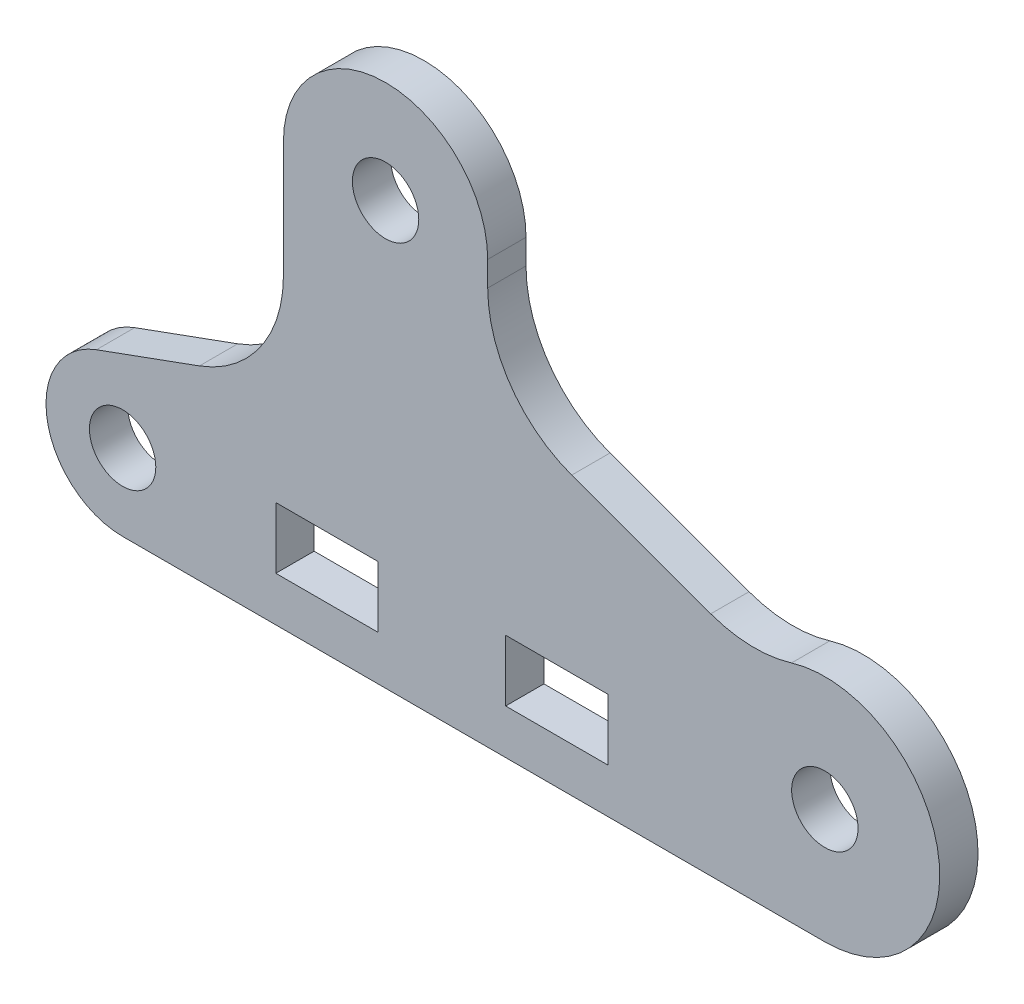
ISO-10303-21;
HEADER;
FILE_DESCRIPTION(('STEP AP214'),'2;1');
FILE_NAME('part.step','',(''),(''),'','','');
FILE_SCHEMA(('AUTOMOTIVE_DESIGN { 1 0 10303 214 1 1 1 1 }'));
ENDSEC;
DATA;
#1=APPLICATION_CONTEXT('core data for automotive mechanical design processes');
#2=APPLICATION_PROTOCOL_DEFINITION('international standard','automotive_design',2000,#1);
#3=PRODUCT_CONTEXT('',#1,'mechanical');
#4=PRODUCT('Part','Part','',(#3));
#5=PRODUCT_RELATED_PRODUCT_CATEGORY('part','',(#4));
#6=PRODUCT_DEFINITION_FORMATION('','',#4);
#7=PRODUCT_DEFINITION_CONTEXT('part definition',#1,'design');
#8=PRODUCT_DEFINITION('design','',#6,#7);
#9=PRODUCT_DEFINITION_SHAPE('','',#8);
#10=(LENGTH_UNIT() NAMED_UNIT(*) SI_UNIT(.MILLI.,.METRE.));
#11=(NAMED_UNIT(*) PLANE_ANGLE_UNIT() SI_UNIT($,.RADIAN.));
#12=(NAMED_UNIT(*) SI_UNIT($,.STERADIAN.) SOLID_ANGLE_UNIT());
#13=UNCERTAINTY_MEASURE_WITH_UNIT(LENGTH_MEASURE(1.E-05),#10,'distance_accuracy_value','');
#14=(GEOMETRIC_REPRESENTATION_CONTEXT(3) GLOBAL_UNCERTAINTY_ASSIGNED_CONTEXT((#13)) GLOBAL_UNIT_ASSIGNED_CONTEXT((#10,
#11,#12)) REPRESENTATION_CONTEXT('',''));
#15=CARTESIAN_POINT('',(0.,0.,0.));
#16=DIRECTION('',(0.,0.,1.));
#17=DIRECTION('',(1.,0.,0.));
#18=AXIS2_PLACEMENT_3D('',#15,#16,#17);
#19=CARTESIAN_POINT('',(-43.,-5.50000000000001,-3.));
#20=DIRECTION('',(0.,-1.,0.));
#21=DIRECTION('',(0.,0.,-1.));
#22=AXIS2_PLACEMENT_3D('',#19,#20,#21);
#23=PLANE('',#22);
#24=DIRECTION('',(0.,0.,1.));
#25=VECTOR('',#24,1.);
#26=CARTESIAN_POINT('',(-43.,-5.50000000000001,-3.));
#27=LINE('',#26,#25);
#28=CARTESIAN_POINT('',(-43.,-5.50000000000001,0.));
#29=VERTEX_POINT('',#28);
#30=CARTESIAN_POINT('',(-43.,-5.50000000000001,3.));
#31=VERTEX_POINT('',#30);
#32=EDGE_CURVE('E207',#29,#31,#27,.T.);
#33=ORIENTED_EDGE('',*,*,#32,.T.);
#34=DIRECTION('',(1.,0.,0.));
#35=VECTOR('',#34,1.);
#36=CARTESIAN_POINT('',(-43.,-5.50000000000001,3.));
#37=LINE('',#36,#35);
#38=CARTESIAN_POINT('',(-35.,-5.50000000000001,3.));
#39=VERTEX_POINT('',#38);
#40=EDGE_CURVE('E210',#31,#39,#37,.T.);
#41=ORIENTED_EDGE('',*,*,#40,.T.);
#42=DIRECTION('',(0.,0.,1.));
#43=VECTOR('',#42,1.);
#44=CARTESIAN_POINT('',(-35.,-5.50000000000001,0.));
#45=LINE('',#44,#43);
#46=CARTESIAN_POINT('',(-35.,-5.50000000000001,0.));
#47=VERTEX_POINT('',#46);
#48=EDGE_CURVE('E199',#47,#39,#45,.T.);
#49=ORIENTED_EDGE('',*,*,#48,.F.);
#50=DIRECTION('',(1.,0.,0.));
#51=VECTOR('',#50,1.);
#52=CARTESIAN_POINT('',(-55.,-5.50000000000001,0.));
#53=LINE('',#52,#51);
#54=EDGE_CURVE('E256',#47,#29,#53,.F.);
#55=ORIENTED_EDGE('',*,*,#54,.T.);
#56=EDGE_LOOP('',(#33,#41,#49,#55));
#57=FACE_BOUND('',#56,.T.);
#58=ADVANCED_FACE('F33',(#57),#23,.F.);
#59=CARTESIAN_POINT('',(-43.,-0.700000000000009,-3.));
#60=DIRECTION('',(-1.,0.,0.));
#61=DIRECTION('',(0.,0.,1.));
#62=AXIS2_PLACEMENT_3D('',#59,#60,#61);
#63=PLANE('',#62);
#64=DIRECTION('',(0.,0.,1.));
#65=VECTOR('',#64,1.);
#66=CARTESIAN_POINT('',(-43.,-0.700000000000009,-3.));
#67=LINE('',#66,#65);
#68=CARTESIAN_POINT('',(-43.,-0.700000000000009,0.));
#69=VERTEX_POINT('',#68);
#70=CARTESIAN_POINT('',(-43.,-0.700000000000009,3.));
#71=VERTEX_POINT('',#70);
#72=EDGE_CURVE('E204',#69,#71,#67,.T.);
#73=ORIENTED_EDGE('',*,*,#72,.T.);
#74=DIRECTION('',(0.,-1.,0.));
#75=VECTOR('',#74,1.);
#76=CARTESIAN_POINT('',(-43.,-0.700000000000009,3.));
#77=LINE('',#76,#75);
#78=EDGE_CURVE('E307',#71,#31,#77,.T.);
#79=ORIENTED_EDGE('',*,*,#78,.T.);
#80=ORIENTED_EDGE('',*,*,#32,.F.);
#81=DIRECTION('',(0.,1.,0.));
#82=VECTOR('',#81,1.);
#83=CARTESIAN_POINT('',(-43.,-3.00000000000001,0.));
#84=LINE('',#83,#82);
#85=EDGE_CURVE('E253',#29,#69,#84,.T.);
#86=ORIENTED_EDGE('',*,*,#85,.T.);
#87=EDGE_LOOP('',(#73,#79,#80,#86));
#88=FACE_BOUND('',#87,.T.);
#89=ADVANCED_FACE('F448',(#88),#63,.F.);
#90=CARTESIAN_POINT('',(-43.,-0.700000000000009,-3.));
#91=DIRECTION('',(0.,1.,0.));
#92=DIRECTION('',(0.,0.,1.));
#93=AXIS2_PLACEMENT_3D('',#90,#91,#92);
#94=PLANE('',#93);
#95=DIRECTION('',(0.,0.,1.));
#96=VECTOR('',#95,1.);
#97=CARTESIAN_POINT('',(-35.,-0.700000000000009,0.));
#98=LINE('',#97,#96);
#99=CARTESIAN_POINT('',(-35.,-0.700000000000009,3.));
#100=VERTEX_POINT('',#99);
#101=CARTESIAN_POINT('',(-35.,-0.700000000000009,0.));
#102=VERTEX_POINT('',#101);
#103=EDGE_CURVE('E202',#100,#102,#98,.F.);
#104=ORIENTED_EDGE('',*,*,#103,.F.);
#105=DIRECTION('',(-1.,0.,0.));
#106=VECTOR('',#105,1.);
#107=CARTESIAN_POINT('',(-43.,-0.700000000000009,3.));
#108=LINE('',#107,#106);
#109=EDGE_CURVE('E47',#100,#71,#108,.T.);
#110=ORIENTED_EDGE('',*,*,#109,.T.);
#111=ORIENTED_EDGE('',*,*,#72,.F.);
#112=DIRECTION('',(1.,0.,0.));
#113=VECTOR('',#112,1.);
#114=CARTESIAN_POINT('',(-55.,-0.700000000000009,0.));
#115=LINE('',#114,#113);
#116=EDGE_CURVE('E250',#69,#102,#115,.T.);
#117=ORIENTED_EDGE('',*,*,#116,.T.);
#118=EDGE_LOOP('',(#104,#110,#111,#117));
#119=FACE_BOUND('',#118,.T.);
#120=ADVANCED_FACE('F445',(#119),#94,.F.);
#121=CARTESIAN_POINT('',(-35.,-0.700000000000009,0.));
#122=DIRECTION('',(-1.,0.,0.));
#123=DIRECTION('',(0.,0.,1.));
#124=AXIS2_PLACEMENT_3D('',#121,#122,#123);
#125=PLANE('',#124);
#126=DIRECTION('',(0.,-1.,0.));
#127=VECTOR('',#126,1.);
#128=CARTESIAN_POINT('',(-35.,-0.700000000000009,3.));
#129=LINE('',#128,#127);
#130=EDGE_CURVE('E311',#100,#39,#129,.T.);
#131=ORIENTED_EDGE('',*,*,#130,.F.);
#132=ORIENTED_EDGE('',*,*,#103,.T.);
#133=DIRECTION('',(0.,1.,0.));
#134=VECTOR('',#133,1.);
#135=CARTESIAN_POINT('',(-35.,-3.00000000000001,0.));
#136=LINE('',#135,#134);
#137=EDGE_CURVE('E247',#102,#47,#136,.F.);
#138=ORIENTED_EDGE('',*,*,#137,.T.);
#139=ORIENTED_EDGE('',*,*,#48,.T.);
#140=EDGE_LOOP('',(#131,#132,#138,#139));
#141=FACE_BOUND('',#140,.T.);
#142=ADVANCED_FACE('F441',(#141),#125,.T.);
#143=CARTESIAN_POINT('',(-17.,-0.700000000000009,-3.));
#144=DIRECTION('',(1.,0.,0.));
#145=DIRECTION('',(0.,0.,-1.));
#146=AXIS2_PLACEMENT_3D('',#143,#144,#145);
#147=PLANE('',#146);
#148=DIRECTION('',(0.,0.,-1.));
#149=VECTOR('',#148,1.);
#150=CARTESIAN_POINT('',(-17.,-5.50000000000001,-3.));
#151=LINE('',#150,#149);
#152=CARTESIAN_POINT('',(-17.,-5.50000000000001,0.));
#153=VERTEX_POINT('',#152);
#154=CARTESIAN_POINT('',(-17.,-5.50000000000001,3.));
#155=VERTEX_POINT('',#154);
#156=EDGE_CURVE('E196',#153,#155,#151,.F.);
#157=ORIENTED_EDGE('',*,*,#156,.T.);
#158=DIRECTION('',(0.,1.,0.));
#159=VECTOR('',#158,1.);
#160=CARTESIAN_POINT('',(-17.,-0.700000000000009,3.));
#161=LINE('',#160,#159);
#162=CARTESIAN_POINT('',(-17.,-0.700000000000009,3.));
#163=VERTEX_POINT('',#162);
#164=EDGE_CURVE('E313',#155,#163,#161,.T.);
#165=ORIENTED_EDGE('',*,*,#164,.T.);
#166=DIRECTION('',(0.,0.,1.));
#167=VECTOR('',#166,1.);
#168=CARTESIAN_POINT('',(-17.,-0.700000000000009,-3.));
#169=LINE('',#168,#167);
#170=CARTESIAN_POINT('',(-17.,-0.700000000000009,0.));
#171=VERTEX_POINT('',#170);
#172=EDGE_CURVE('E189',#163,#171,#169,.F.);
#173=ORIENTED_EDGE('',*,*,#172,.T.);
#174=DIRECTION('',(0.,1.,0.));
#175=VECTOR('',#174,1.);
#176=CARTESIAN_POINT('',(-17.,-3.00000000000001,0.));
#177=LINE('',#176,#175);
#178=EDGE_CURVE('E244',#171,#153,#177,.F.);
#179=ORIENTED_EDGE('',*,*,#178,.T.);
#180=EDGE_LOOP('',(#157,#165,#173,#179));
#181=FACE_BOUND('',#180,.T.);
#182=ADVANCED_FACE('F437',(#181),#147,.F.);
#183=CARTESIAN_POINT('',(-43.,-5.50000000000001,-3.));
#184=DIRECTION('',(0.,-1.,0.));
#185=DIRECTION('',(0.,0.,-1.));
#186=AXIS2_PLACEMENT_3D('',#183,#184,#185);
#187=PLANE('',#186);
#188=DIRECTION('',(0.,0.,-1.));
#189=VECTOR('',#188,1.);
#190=CARTESIAN_POINT('',(-25.,-5.50000000000001,0.));
#191=LINE('',#190,#189);
#192=CARTESIAN_POINT('',(-25.,-5.50000000000001,3.));
#193=VERTEX_POINT('',#192);
#194=CARTESIAN_POINT('',(-25.,-5.50000000000001,0.));
#195=VERTEX_POINT('',#194);
#196=EDGE_CURVE('E194',#193,#195,#191,.T.);
#197=ORIENTED_EDGE('',*,*,#196,.F.);
#198=DIRECTION('',(1.,0.,0.));
#199=VECTOR('',#198,1.);
#200=CARTESIAN_POINT('',(-43.,-5.50000000000001,3.));
#201=LINE('',#200,#199);
#202=EDGE_CURVE('E316',#193,#155,#201,.T.);
#203=ORIENTED_EDGE('',*,*,#202,.T.);
#204=ORIENTED_EDGE('',*,*,#156,.F.);
#205=DIRECTION('',(1.,0.,0.));
#206=VECTOR('',#205,1.);
#207=CARTESIAN_POINT('',(-55.,-5.50000000000001,0.));
#208=LINE('',#207,#206);
#209=EDGE_CURVE('E238',#153,#195,#208,.F.);
#210=ORIENTED_EDGE('',*,*,#209,.T.);
#211=EDGE_LOOP('',(#197,#203,#204,#210));
#212=FACE_BOUND('',#211,.T.);
#213=ADVANCED_FACE('F433',(#212),#187,.F.);
#214=CARTESIAN_POINT('',(-25.,-0.700000000000009,0.));
#215=DIRECTION('',(1.,0.,0.));
#216=DIRECTION('',(0.,0.,-1.));
#217=AXIS2_PLACEMENT_3D('',#214,#215,#216);
#218=PLANE('',#217);
#219=DIRECTION('',(0.,1.,0.));
#220=VECTOR('',#219,1.);
#221=CARTESIAN_POINT('',(-25.,-0.700000000000009,3.));
#222=LINE('',#221,#220);
#223=CARTESIAN_POINT('',(-25.,-0.700000000000009,3.));
#224=VERTEX_POINT('',#223);
#225=EDGE_CURVE('E55',#193,#224,#222,.T.);
#226=ORIENTED_EDGE('',*,*,#225,.F.);
#227=ORIENTED_EDGE('',*,*,#196,.T.);
#228=DIRECTION('',(0.,1.,0.));
#229=VECTOR('',#228,1.);
#230=CARTESIAN_POINT('',(-25.,-3.00000000000001,0.));
#231=LINE('',#230,#229);
#232=CARTESIAN_POINT('',(-25.,-0.700000000000009,0.));
#233=VERTEX_POINT('',#232);
#234=EDGE_CURVE('E232',#195,#233,#231,.T.);
#235=ORIENTED_EDGE('',*,*,#234,.T.);
#236=DIRECTION('',(0.,0.,1.));
#237=VECTOR('',#236,1.);
#238=CARTESIAN_POINT('',(-25.,-0.700000000000009,-3.));
#239=LINE('',#238,#237);
#240=EDGE_CURVE('E184',#233,#224,#239,.T.);
#241=ORIENTED_EDGE('',*,*,#240,.T.);
#242=EDGE_LOOP('',(#226,#227,#235,#241));
#243=FACE_BOUND('',#242,.T.);
#244=ADVANCED_FACE('F430',(#243),#218,.T.);
#245=CARTESIAN_POINT('',(-43.,-0.700000000000009,-3.));
#246=DIRECTION('',(0.,1.,0.));
#247=DIRECTION('',(0.,0.,1.));
#248=AXIS2_PLACEMENT_3D('',#245,#246,#247);
#249=PLANE('',#248);
#250=ORIENTED_EDGE('',*,*,#172,.F.);
#251=DIRECTION('',(-1.,0.,0.));
#252=VECTOR('',#251,1.);
#253=CARTESIAN_POINT('',(-43.,-0.700000000000009,3.));
#254=LINE('',#253,#252);
#255=EDGE_CURVE('E177',#163,#224,#254,.T.);
#256=ORIENTED_EDGE('',*,*,#255,.T.);
#257=ORIENTED_EDGE('',*,*,#240,.F.);
#258=DIRECTION('',(1.,0.,0.));
#259=VECTOR('',#258,1.);
#260=CARTESIAN_POINT('',(-55.,-0.700000000000009,0.));
#261=LINE('',#260,#259);
#262=EDGE_CURVE('E229',#233,#171,#261,.T.);
#263=ORIENTED_EDGE('',*,*,#262,.T.);
#264=EDGE_LOOP('',(#250,#256,#257,#263));
#265=FACE_BOUND('',#264,.T.);
#266=ADVANCED_FACE('F427',(#265),#249,.F.);
#267=CARTESIAN_POINT('',(0.,-9.,5.));
#268=DIRECTION('',(0.,1.,0.));
#269=DIRECTION('',(-1.,0.,0.));
#270=AXIS2_PLACEMENT_3D('',#267,#268,#269);
#271=PLANE('',#270);
#272=DIRECTION('',(0.,0.,-1.));
#273=VECTOR('',#272,1.);
#274=CARTESIAN_POINT('',(0.,-9.,5.));
#275=LINE('',#274,#273);
#276=CARTESIAN_POINT('',(0.,-9.,3.));
#277=VERTEX_POINT('',#276);
#278=CARTESIAN_POINT('',(0.,-9.00000000000001,0.));
#279=VERTEX_POINT('',#278);
#280=EDGE_CURVE('E176',#277,#279,#275,.T.);
#281=ORIENTED_EDGE('',*,*,#280,.F.);
#282=DIRECTION('',(-1.,0.,0.));
#283=VECTOR('',#282,1.);
#284=CARTESIAN_POINT('',(0.,-9.,3.));
#285=LINE('',#284,#283);
#286=CARTESIAN_POINT('',(-55.,-9.00000000000001,3.));
#287=VERTEX_POINT('',#286);
#288=EDGE_CURVE('E163',#277,#287,#285,.T.);
#289=ORIENTED_EDGE('',*,*,#288,.T.);
#290=DIRECTION('',(0.,0.,1.));
#291=VECTOR('',#290,1.);
#292=CARTESIAN_POINT('',(-55.,-9.00000000000001,5.));
#293=LINE('',#292,#291);
#294=CARTESIAN_POINT('',(-55.,-9.00000000000001,0.));
#295=VERTEX_POINT('',#294);
#296=EDGE_CURVE('E174',#295,#287,#293,.T.);
#297=ORIENTED_EDGE('',*,*,#296,.F.);
#298=DIRECTION('',(1.,0.,0.));
#299=VECTOR('',#298,1.);
#300=CARTESIAN_POINT('',(-55.,-9.00000000000001,0.));
#301=LINE('',#300,#299);
#302=EDGE_CURVE('E228',#295,#279,#301,.T.);
#303=ORIENTED_EDGE('',*,*,#302,.T.);
#304=EDGE_LOOP('',(#281,#289,#297,#303));
#305=FACE_BOUND('',#304,.T.);
#306=ADVANCED_FACE('F172',(#305),#271,.F.);
#307=CARTESIAN_POINT('',(0.,0.,5.));
#308=DIRECTION('',(0.,0.,-1.));
#309=DIRECTION('',(-1.,0.,0.));
#310=AXIS2_PLACEMENT_3D('',#307,#308,#309);
#311=CYLINDRICAL_SURFACE('',#310,9.);
#312=CARTESIAN_POINT('',(0.,0.,3.));
#313=DIRECTION('',(0.,0.,-1.));
#314=DIRECTION('',(-1.,0.,0.));
#315=AXIS2_PLACEMENT_3D('',#312,#313,#314);
#316=CIRCLE('',#315,9.);
#317=CARTESIAN_POINT('',(-2.61173540827363,8.61271375102933,3.));
#318=VERTEX_POINT('',#317);
#319=EDGE_CURVE('E178',#277,#318,#316,.F.);
#320=ORIENTED_EDGE('',*,*,#319,.F.);
#321=ORIENTED_EDGE('',*,*,#280,.T.);
#322=CARTESIAN_POINT('',(0.,0.,0.));
#323=DIRECTION('',(0.,0.,-1.));
#324=DIRECTION('',(-1.,0.,0.));
#325=AXIS2_PLACEMENT_3D('',#322,#323,#324);
#326=CIRCLE('',#325,9.);
#327=CARTESIAN_POINT('',(-2.61173540827363,8.61271375102933,0.));
#328=VERTEX_POINT('',#327);
#329=EDGE_CURVE('E226',#279,#328,#326,.F.);
#330=ORIENTED_EDGE('',*,*,#329,.T.);
#331=DIRECTION('',(0.,0.,-1.));
#332=VECTOR('',#331,1.);
#333=CARTESIAN_POINT('',(-2.61173540827363,8.61271375102933,5.));
#334=LINE('',#333,#332);
#335=EDGE_CURVE('E186',#328,#318,#334,.F.);
#336=ORIENTED_EDGE('',*,*,#335,.T.);
#337=EDGE_LOOP('',(#320,#321,#330,#336));
#338=FACE_BOUND('',#337,.T.);
#339=ADVANCED_FACE('F282',(#338),#311,.T.);
#340=CARTESIAN_POINT('',(-5.51366363968878,18.1823956966175,5.));
#341=DIRECTION('',(0.,0.,-1.));
#342=DIRECTION('',(-1.,0.,0.));
#343=AXIS2_PLACEMENT_3D('',#340,#341,#342);
#344=CYLINDRICAL_SURFACE('',#343,10.);
#345=DIRECTION('',(0.,0.,1.));
#346=VECTOR('',#345,1.);
#347=CARTESIAN_POINT('',(-8.93386507294544,8.78546948875838,5.));
#348=LINE('',#347,#346);
#349=CARTESIAN_POINT('',(-8.93386507294544,8.78546948875838,0.));
#350=VERTEX_POINT('',#349);
#351=CARTESIAN_POINT('',(-8.93386507294545,8.78546948875838,3.));
#352=VERTEX_POINT('',#351);
#353=EDGE_CURVE('E278',#350,#352,#348,.T.);
#354=ORIENTED_EDGE('',*,*,#353,.T.);
#355=CARTESIAN_POINT('',(-5.51366363968878,18.1823956966175,3.));
#356=DIRECTION('',(0.,0.,-1.));
#357=DIRECTION('',(-1.,0.,0.));
#358=AXIS2_PLACEMENT_3D('',#355,#356,#357);
#359=CIRCLE('',#358,10.);
#360=EDGE_CURVE('E288',#352,#318,#359,.F.);
#361=ORIENTED_EDGE('',*,*,#360,.T.);
#362=ORIENTED_EDGE('',*,*,#335,.F.);
#363=CARTESIAN_POINT('',(-5.51366363968878,18.1823956966175,0.));
#364=DIRECTION('',(0.,0.,-1.));
#365=DIRECTION('',(-1.,0.,0.));
#366=AXIS2_PLACEMENT_3D('',#363,#364,#365);
#367=CIRCLE('',#366,10.);
#368=EDGE_CURVE('E223',#328,#350,#367,.T.);
#369=ORIENTED_EDGE('',*,*,#368,.T.);
#370=EDGE_LOOP('',(#354,#361,#362,#369));
#371=FACE_BOUND('',#370,.T.);
#372=ADVANCED_FACE('F287',(#371),#344,.F.);
#373=CARTESIAN_POINT('',(-26.4043858601376,15.1442190324252,5.));
#374=DIRECTION('',(-0.342020143325666,-0.93969262078591,0.));
#375=DIRECTION('',(0.93969262078591,-0.342020143325666,0.));
#376=AXIS2_PLACEMENT_3D('',#373,#374,#375);
#377=PLANE('',#376);
#378=DIRECTION('',(0.,0.,1.));
#379=VECTOR('',#378,1.);
#380=CARTESIAN_POINT('',(-19.8245872933943,12.7493682066632,5.));
#381=LINE('',#380,#379);
#382=CARTESIAN_POINT('',(-19.8245872933943,12.7493682066632,0.));
#383=VERTEX_POINT('',#382);
#384=CARTESIAN_POINT('',(-19.8245872933943,12.7493682066632,3.));
#385=VERTEX_POINT('',#384);
#386=EDGE_CURVE('E275',#383,#385,#381,.T.);
#387=ORIENTED_EDGE('',*,*,#386,.T.);
#388=DIRECTION('',(0.93969262078591,-0.342020143325666,0.));
#389=VECTOR('',#388,1.);
#390=CARTESIAN_POINT('',(-26.4043858601376,15.1442190324252,3.));
#391=LINE('',#390,#389);
#392=EDGE_CURVE('E323',#385,#352,#391,.T.);
#393=ORIENTED_EDGE('',*,*,#392,.T.);
#394=ORIENTED_EDGE('',*,*,#353,.F.);
#395=DIRECTION('',(-0.93969262078591,0.342020143325666,0.));
#396=VECTOR('',#395,1.);
#397=CARTESIAN_POINT('',(-8.93386507294545,8.78546948875838,0.));
#398=LINE('',#397,#396);
#399=EDGE_CURVE('E222',#350,#383,#398,.T.);
#400=ORIENTED_EDGE('',*,*,#399,.T.);
#401=EDGE_LOOP('',(#387,#393,#394,#400));
#402=FACE_BOUND('',#401,.T.);
#403=ADVANCED_FACE('F417',(#402),#377,.F.);
#404=CARTESIAN_POINT('',(-16.4043858601376,22.1462944145223,5.));
#405=DIRECTION('',(0.,0.,1.));
#406=DIRECTION('',(1.,0.,0.));
#407=AXIS2_PLACEMENT_3D('',#404,#405,#406);
#408=CYLINDRICAL_SURFACE('',#407,10.);
#409=DIRECTION('',(0.,0.,1.));
#410=VECTOR('',#409,1.);
#411=CARTESIAN_POINT('',(-26.4043858601376,22.1462944145223,5.));
#412=LINE('',#411,#410);
#413=CARTESIAN_POINT('',(-26.4043858601376,22.1462944145223,0.));
#414=VERTEX_POINT('',#413);
#415=CARTESIAN_POINT('',(-26.4043858601376,22.1462944145223,3.));
#416=VERTEX_POINT('',#415);
#417=EDGE_CURVE('E272',#414,#416,#412,.T.);
#418=ORIENTED_EDGE('',*,*,#417,.T.);
#419=CARTESIAN_POINT('',(-16.4043858601376,22.1462944145223,3.));
#420=DIRECTION('',(0.,0.,-1.));
#421=DIRECTION('',(-1.,0.,0.));
#422=AXIS2_PLACEMENT_3D('',#419,#420,#421);
#423=CIRCLE('',#422,10.);
#424=EDGE_CURVE('E326',#416,#385,#423,.F.);
#425=ORIENTED_EDGE('',*,*,#424,.T.);
#426=ORIENTED_EDGE('',*,*,#386,.F.);
#427=CARTESIAN_POINT('',(-16.4043858601376,22.1462944145223,0.));
#428=DIRECTION('',(0.,0.,1.));
#429=DIRECTION('',(1.,0.,0.));
#430=AXIS2_PLACEMENT_3D('',#427,#428,#429);
#431=CIRCLE('',#430,10.);
#432=EDGE_CURVE('E219',#383,#414,#431,.F.);
#433=ORIENTED_EDGE('',*,*,#432,.T.);
#434=EDGE_LOOP('',(#418,#425,#426,#433));
#435=FACE_BOUND('',#434,.T.);
#436=ADVANCED_FACE('F413',(#435),#408,.F.);
#437=CARTESIAN_POINT('',(-26.4043858601376,24.090210326744,5.));
#438=DIRECTION('',(-1.,0.,0.));
#439=DIRECTION('',(0.,0.,1.));
#440=AXIS2_PLACEMENT_3D('',#437,#438,#439);
#441=PLANE('',#440);
#442=DIRECTION('',(0.,0.,-1.));
#443=VECTOR('',#442,1.);
#444=CARTESIAN_POINT('',(-26.4043858601376,24.090210326744,5.));
#445=LINE('',#444,#443);
#446=CARTESIAN_POINT('',(-26.4043858601376,24.090210326744,3.));
#447=VERTEX_POINT('',#446);
#448=CARTESIAN_POINT('',(-26.4043858601376,24.090210326744,0.));
#449=VERTEX_POINT('',#448);
#450=EDGE_CURVE('E270',#447,#449,#445,.T.);
#451=ORIENTED_EDGE('',*,*,#450,.F.);
#452=DIRECTION('',(0.,-1.,0.));
#453=VECTOR('',#452,1.);
#454=CARTESIAN_POINT('',(-26.4043858601376,24.090210326744,3.));
#455=LINE('',#454,#453);
#456=EDGE_CURVE('E329',#447,#416,#455,.T.);
#457=ORIENTED_EDGE('',*,*,#456,.T.);
#458=ORIENTED_EDGE('',*,*,#417,.F.);
#459=DIRECTION('',(0.,1.,0.));
#460=VECTOR('',#459,1.);
#461=CARTESIAN_POINT('',(-26.4043858601376,-3.00000000000001,0.));
#462=LINE('',#461,#460);
#463=EDGE_CURVE('E218',#414,#449,#462,.T.);
#464=ORIENTED_EDGE('',*,*,#463,.T.);
#465=EDGE_LOOP('',(#451,#457,#458,#464));
#466=FACE_BOUND('',#465,.T.);
#467=ADVANCED_FACE('F409',(#466),#441,.F.);
#468=CARTESIAN_POINT('',(-34.4043858601376,24.090210326744,5.));
#469=DIRECTION('',(0.,0.,-1.));
#470=DIRECTION('',(-1.,0.,0.));
#471=AXIS2_PLACEMENT_3D('',#468,#469,#470);
#472=CYLINDRICAL_SURFACE('',#471,8.);
#473=CARTESIAN_POINT('',(-34.4043858601376,24.090210326744,3.));
#474=DIRECTION('',(0.,0.,-1.));
#475=DIRECTION('',(-1.,0.,0.));
#476=AXIS2_PLACEMENT_3D('',#473,#474,#475);
#477=CIRCLE('',#476,8.);
#478=CARTESIAN_POINT('',(-42.4043858601376,24.090210326744,3.));
#479=VERTEX_POINT('',#478);
#480=EDGE_CURVE('E332',#447,#479,#477,.F.);
#481=ORIENTED_EDGE('',*,*,#480,.F.);
#482=ORIENTED_EDGE('',*,*,#450,.T.);
#483=CARTESIAN_POINT('',(-34.4043858601376,24.090210326744,0.));
#484=DIRECTION('',(0.,0.,-1.));
#485=DIRECTION('',(-1.,0.,0.));
#486=AXIS2_PLACEMENT_3D('',#483,#484,#485);
#487=CIRCLE('',#486,8.);
#488=CARTESIAN_POINT('',(-42.4043858601376,24.090210326744,0.));
#489=VERTEX_POINT('',#488);
#490=EDGE_CURVE('E215',#449,#489,#487,.F.);
#491=ORIENTED_EDGE('',*,*,#490,.T.);
#492=DIRECTION('',(0.,0.,1.));
#493=VECTOR('',#492,1.);
#494=CARTESIAN_POINT('',(-42.4043858601376,24.090210326744,5.));
#495=LINE('',#494,#493);
#496=EDGE_CURVE('E267',#489,#479,#495,.T.);
#497=ORIENTED_EDGE('',*,*,#496,.T.);
#498=EDGE_LOOP('',(#481,#482,#491,#497));
#499=FACE_BOUND('',#498,.T.);
#500=ADVANCED_FACE('F405',(#499),#472,.T.);
#501=CARTESIAN_POINT('',(-42.4043858601376,24.090210326744,5.));
#502=DIRECTION('',(1.,0.,0.));
#503=DIRECTION('',(0.,1.,0.));
#504=AXIS2_PLACEMENT_3D('',#501,#502,#503);
#505=PLANE('',#504);
#506=DIRECTION('',(0.,0.,1.));
#507=VECTOR('',#506,1.);
#508=CARTESIAN_POINT('',(-42.4043858601376,14.971570646165,5.));
#509=LINE('',#508,#507);
#510=CARTESIAN_POINT('',(-42.4043858601376,14.971570646165,0.));
#511=VERTEX_POINT('',#510);
#512=CARTESIAN_POINT('',(-42.4043858601376,14.971570646165,3.));
#513=VERTEX_POINT('',#512);
#514=EDGE_CURVE('E264',#511,#513,#509,.T.);
#515=ORIENTED_EDGE('',*,*,#514,.T.);
#516=DIRECTION('',(0.,1.,0.));
#517=VECTOR('',#516,1.);
#518=CARTESIAN_POINT('',(-42.4043858601376,24.090210326744,3.));
#519=LINE('',#518,#517);
#520=EDGE_CURVE('E334',#513,#479,#519,.T.);
#521=ORIENTED_EDGE('',*,*,#520,.T.);
#522=ORIENTED_EDGE('',*,*,#496,.F.);
#523=DIRECTION('',(0.,1.,0.));
#524=VECTOR('',#523,1.);
#525=CARTESIAN_POINT('',(-42.4043858601376,-3.00000000000001,0.));
#526=LINE('',#525,#524);
#527=EDGE_CURVE('E214',#489,#511,#526,.F.);
#528=ORIENTED_EDGE('',*,*,#527,.T.);
#529=EDGE_LOOP('',(#515,#521,#522,#528));
#530=FACE_BOUND('',#529,.T.);
#531=ADVANCED_FACE('F401',(#530),#505,.F.);
#532=CARTESIAN_POINT('',(-52.4043858601376,14.971570646165,5.));
#533=DIRECTION('',(0.,0.,1.));
#534=DIRECTION('',(1.,0.,0.));
#535=AXIS2_PLACEMENT_3D('',#532,#533,#534);
#536=CYLINDRICAL_SURFACE('',#535,10.);
#537=DIRECTION('',(0.,0.,1.));
#538=VECTOR('',#537,1.);
#539=CARTESIAN_POINT('',(-48.9841844268809,5.57464443830594,5.));
#540=LINE('',#539,#538);
#541=CARTESIAN_POINT('',(-48.9841844268809,5.57464443830594,0.));
#542=VERTEX_POINT('',#541);
#543=CARTESIAN_POINT('',(-48.9841844268809,5.57464443830594,3.));
#544=VERTEX_POINT('',#543);
#545=EDGE_CURVE('E261',#542,#544,#540,.T.);
#546=ORIENTED_EDGE('',*,*,#545,.T.);
#547=CARTESIAN_POINT('',(-52.4043858601376,14.971570646165,3.));
#548=DIRECTION('',(0.,0.,-1.));
#549=DIRECTION('',(-1.,0.,0.));
#550=AXIS2_PLACEMENT_3D('',#547,#548,#549);
#551=CIRCLE('',#550,10.);
#552=EDGE_CURVE('E337',#544,#513,#551,.F.);
#553=ORIENTED_EDGE('',*,*,#552,.T.);
#554=ORIENTED_EDGE('',*,*,#514,.F.);
#555=CARTESIAN_POINT('',(-52.4043858601376,14.971570646165,0.));
#556=DIRECTION('',(0.,0.,1.));
#557=DIRECTION('',(1.,0.,0.));
#558=AXIS2_PLACEMENT_3D('',#555,#556,#557);
#559=CIRCLE('',#558,10.);
#560=EDGE_CURVE('E211',#511,#542,#559,.F.);
#561=ORIENTED_EDGE('',*,*,#560,.T.);
#562=EDGE_LOOP('',(#546,#553,#554,#561));
#563=FACE_BOUND('',#562,.T.);
#564=ADVANCED_FACE('F397',(#563),#536,.F.);
#565=CARTESIAN_POINT('',(-57.052120859954,2.63815572471544,5.));
#566=DIRECTION('',(0.342020143325673,-0.939692620785907,0.));
#567=DIRECTION('',(0.939692620785907,0.342020143325673,0.));
#568=AXIS2_PLACEMENT_3D('',#565,#566,#567);
#569=PLANE('',#568);
#570=DIRECTION('',(0.,0.,-1.));
#571=VECTOR('',#570,1.);
#572=CARTESIAN_POINT('',(-57.052120859954,2.63815572471543,5.));
#573=LINE('',#572,#571);
#574=CARTESIAN_POINT('',(-57.052120859954,2.63815572471543,3.));
#575=VERTEX_POINT('',#574);
#576=CARTESIAN_POINT('',(-57.052120859954,2.63815572471543,0.));
#577=VERTEX_POINT('',#576);
#578=EDGE_CURVE('E259',#575,#577,#573,.T.);
#579=ORIENTED_EDGE('',*,*,#578,.F.);
#580=DIRECTION('',(0.939692620785907,0.342020143325673,0.));
#581=VECTOR('',#580,1.);
#582=CARTESIAN_POINT('',(-57.052120859954,2.63815572471544,3.));
#583=LINE('',#582,#581);
#584=EDGE_CURVE('E166',#575,#544,#583,.T.);
#585=ORIENTED_EDGE('',*,*,#584,.T.);
#586=ORIENTED_EDGE('',*,*,#545,.F.);
#587=DIRECTION('',(-0.939692620785907,-0.342020143325673,0.));
#588=VECTOR('',#587,1.);
#589=CARTESIAN_POINT('',(-48.9841844268809,5.57464443830594,0.));
#590=LINE('',#589,#588);
#591=EDGE_CURVE('E40',#542,#577,#590,.T.);
#592=ORIENTED_EDGE('',*,*,#591,.T.);
#593=EDGE_LOOP('',(#579,#585,#586,#592));
#594=FACE_BOUND('',#593,.T.);
#595=ADVANCED_FACE('F392',(#594),#569,.F.);
#596=CARTESIAN_POINT('',(-55.,-3.00000000000001,5.));
#597=DIRECTION('',(0.,0.,-1.));
#598=DIRECTION('',(-1.,0.,0.));
#599=AXIS2_PLACEMENT_3D('',#596,#597,#598);
#600=CYLINDRICAL_SURFACE('',#599,6.);
#601=CARTESIAN_POINT('',(-55.,-3.00000000000001,3.));
#602=DIRECTION('',(0.,0.,-1.));
#603=DIRECTION('',(-1.,0.,0.));
#604=AXIS2_PLACEMENT_3D('',#601,#602,#603);
#605=CIRCLE('',#604,6.);
#606=EDGE_CURVE('E11',#575,#287,#605,.F.);
#607=ORIENTED_EDGE('',*,*,#606,.F.);
#608=ORIENTED_EDGE('',*,*,#578,.T.);
#609=CARTESIAN_POINT('',(-55.,-3.00000000000001,0.));
#610=DIRECTION('',(0.,0.,-1.));
#611=DIRECTION('',(-1.,0.,0.));
#612=AXIS2_PLACEMENT_3D('',#609,#610,#611);
#613=CIRCLE('',#612,6.);
#614=EDGE_CURVE('E183',#577,#295,#613,.F.);
#615=ORIENTED_EDGE('',*,*,#614,.T.);
#616=ORIENTED_EDGE('',*,*,#296,.T.);
#617=EDGE_LOOP('',(#607,#608,#615,#616));
#618=FACE_BOUND('',#617,.T.);
#619=ADVANCED_FACE('F181',(#618),#600,.T.);
#620=CARTESIAN_POINT('',(-55.,-3.00000000000001,0.));
#621=DIRECTION('',(0.,0.,1.));
#622=DIRECTION('',(1.,0.,0.));
#623=AXIS2_PLACEMENT_3D('',#620,#621,#622);
#624=PLANE('',#623);
#625=CARTESIAN_POINT('',(-55.,-3.00000000000001,0.));
#626=DIRECTION('',(0.,0.,1.));
#627=DIRECTION('',(1.,0.,0.));
#628=AXIS2_PLACEMENT_3D('',#625,#626,#627);
#629=CIRCLE('',#628,2.6);
#630=CARTESIAN_POINT('',(-52.4,-3.00000000000001,0.));
#631=VERTEX_POINT('',#630);
#632=EDGE_CURVE('E345',#631,#631,#629,.T.);
#633=ORIENTED_EDGE('',*,*,#632,.T.);
#634=EDGE_LOOP('',(#633));
#635=FACE_BOUND('',#634,.T.);
#636=CARTESIAN_POINT('',(0.,0.,0.));
#637=DIRECTION('',(0.,0.,1.));
#638=DIRECTION('',(1.,0.,0.));
#639=AXIS2_PLACEMENT_3D('',#636,#637,#638);
#640=CIRCLE('',#639,2.6);
#641=CARTESIAN_POINT('',(2.6,0.,0.));
#642=VERTEX_POINT('',#641);
#643=EDGE_CURVE('E351',#642,#642,#640,.T.);
#644=ORIENTED_EDGE('',*,*,#643,.T.);
#645=EDGE_LOOP('',(#644));
#646=FACE_BOUND('',#645,.T.);
#647=CARTESIAN_POINT('',(-34.4043858601376,24.090210326744,0.));
#648=DIRECTION('',(0.,0.,1.));
#649=DIRECTION('',(1.,0.,0.));
#650=AXIS2_PLACEMENT_3D('',#647,#648,#649);
#651=CIRCLE('',#650,2.6);
#652=CARTESIAN_POINT('',(-31.8043858601376,24.090210326744,0.));
#653=VERTEX_POINT('',#652);
#654=EDGE_CURVE('E341',#653,#653,#651,.T.);
#655=ORIENTED_EDGE('',*,*,#654,.T.);
#656=EDGE_LOOP('',(#655));
#657=FACE_BOUND('',#656,.T.);
#658=ORIENTED_EDGE('',*,*,#591,.F.);
#659=ORIENTED_EDGE('',*,*,#560,.F.);
#660=ORIENTED_EDGE('',*,*,#527,.F.);
#661=ORIENTED_EDGE('',*,*,#490,.F.);
#662=ORIENTED_EDGE('',*,*,#463,.F.);
#663=ORIENTED_EDGE('',*,*,#432,.F.);
#664=ORIENTED_EDGE('',*,*,#399,.F.);
#665=ORIENTED_EDGE('',*,*,#368,.F.);
#666=ORIENTED_EDGE('',*,*,#329,.F.);
#667=ORIENTED_EDGE('',*,*,#302,.F.);
#668=ORIENTED_EDGE('',*,*,#614,.F.);
#669=EDGE_LOOP('',(#658,#659,#660,#661,#662,#663,#664,#665,#666,#667,#668));
#670=FACE_BOUND('',#669,.T.);
#671=ORIENTED_EDGE('',*,*,#234,.F.);
#672=ORIENTED_EDGE('',*,*,#209,.F.);
#673=ORIENTED_EDGE('',*,*,#178,.F.);
#674=ORIENTED_EDGE('',*,*,#262,.F.);
#675=EDGE_LOOP('',(#671,#672,#673,#674));
#676=FACE_BOUND('',#675,.T.);
#677=ORIENTED_EDGE('',*,*,#116,.F.);
#678=ORIENTED_EDGE('',*,*,#85,.F.);
#679=ORIENTED_EDGE('',*,*,#54,.F.);
#680=ORIENTED_EDGE('',*,*,#137,.F.);
#681=EDGE_LOOP('',(#677,#678,#679,#680));
#682=FACE_BOUND('',#681,.T.);
#683=ADVANCED_FACE('F292',(#635,#646,#657,#670,#676,#682),#624,.F.);
#684=CARTESIAN_POINT('',(0.,0.,3.));
#685=DIRECTION('',(0.,0.,-1.));
#686=DIRECTION('',(-1.,0.,0.));
#687=AXIS2_PLACEMENT_3D('',#684,#685,#686);
#688=PLANE('',#687);
#689=CARTESIAN_POINT('',(-55.,-3.00000000000001,3.));
#690=DIRECTION('',(0.,0.,1.));
#691=DIRECTION('',(1.,0.,0.));
#692=AXIS2_PLACEMENT_3D('',#689,#690,#691);
#693=CIRCLE('',#692,2.6);
#694=CARTESIAN_POINT('',(-52.4,-3.00000000000001,3.));
#695=VERTEX_POINT('',#694);
#696=EDGE_CURVE('E354',#695,#695,#693,.T.);
#697=ORIENTED_EDGE('',*,*,#696,.F.);
#698=EDGE_LOOP('',(#697));
#699=FACE_BOUND('',#698,.T.);
#700=CARTESIAN_POINT('',(0.,0.,3.));
#701=DIRECTION('',(0.,0.,1.));
#702=DIRECTION('',(1.,0.,0.));
#703=AXIS2_PLACEMENT_3D('',#700,#701,#702);
#704=CIRCLE('',#703,2.6);
#705=CARTESIAN_POINT('',(2.6,0.,3.));
#706=VERTEX_POINT('',#705);
#707=EDGE_CURVE('E348',#706,#706,#704,.T.);
#708=ORIENTED_EDGE('',*,*,#707,.F.);
#709=EDGE_LOOP('',(#708));
#710=FACE_BOUND('',#709,.T.);
#711=CARTESIAN_POINT('',(-34.4043858601376,24.090210326744,3.));
#712=DIRECTION('',(0.,0.,1.));
#713=DIRECTION('',(1.,0.,0.));
#714=AXIS2_PLACEMENT_3D('',#711,#712,#713);
#715=CIRCLE('',#714,2.6);
#716=CARTESIAN_POINT('',(-31.8043858601376,24.090210326744,3.));
#717=VERTEX_POINT('',#716);
#718=EDGE_CURVE('E342',#717,#717,#715,.T.);
#719=ORIENTED_EDGE('',*,*,#718,.F.);
#720=EDGE_LOOP('',(#719));
#721=FACE_BOUND('',#720,.T.);
#722=ORIENTED_EDGE('',*,*,#319,.T.);
#723=ORIENTED_EDGE('',*,*,#360,.F.);
#724=ORIENTED_EDGE('',*,*,#392,.F.);
#725=ORIENTED_EDGE('',*,*,#424,.F.);
#726=ORIENTED_EDGE('',*,*,#456,.F.);
#727=ORIENTED_EDGE('',*,*,#480,.T.);
#728=ORIENTED_EDGE('',*,*,#520,.F.);
#729=ORIENTED_EDGE('',*,*,#552,.F.);
#730=ORIENTED_EDGE('',*,*,#584,.F.);
#731=ORIENTED_EDGE('',*,*,#606,.T.);
#732=ORIENTED_EDGE('',*,*,#288,.F.);
#733=EDGE_LOOP('',(#722,#723,#724,#725,#726,#727,#728,#729,#730,#731,#732));
#734=FACE_BOUND('',#733,.T.);
#735=ORIENTED_EDGE('',*,*,#202,.F.);
#736=ORIENTED_EDGE('',*,*,#225,.T.);
#737=ORIENTED_EDGE('',*,*,#255,.F.);
#738=ORIENTED_EDGE('',*,*,#164,.F.);
#739=EDGE_LOOP('',(#735,#736,#737,#738));
#740=FACE_BOUND('',#739,.T.);
#741=ORIENTED_EDGE('',*,*,#78,.F.);
#742=ORIENTED_EDGE('',*,*,#109,.F.);
#743=ORIENTED_EDGE('',*,*,#130,.T.);
#744=ORIENTED_EDGE('',*,*,#40,.F.);
#745=EDGE_LOOP('',(#741,#742,#743,#744));
#746=FACE_BOUND('',#745,.T.);
#747=ADVANCED_FACE('F162',(#699,#710,#721,#734,#740,#746),#688,.F.);
#748=CARTESIAN_POINT('',(-34.4043858601376,24.090210326744,0.));
#749=DIRECTION('',(0.,0.,1.));
#750=DIRECTION('',(1.,0.,0.));
#751=AXIS2_PLACEMENT_3D('',#748,#749,#750);
#752=CYLINDRICAL_SURFACE('',#751,2.6);
#753=ORIENTED_EDGE('',*,*,#654,.F.);
#754=EDGE_LOOP('',(#753));
#755=FACE_BOUND('',#754,.T.);
#756=ORIENTED_EDGE('',*,*,#718,.T.);
#757=EDGE_LOOP('',(#756));
#758=FACE_BOUND('',#757,.T.);
#759=ADVANCED_FACE('F371',(#755,#758),#752,.F.);
#760=CARTESIAN_POINT('',(0.,0.,0.));
#761=DIRECTION('',(0.,0.,1.));
#762=DIRECTION('',(1.,0.,0.));
#763=AXIS2_PLACEMENT_3D('',#760,#761,#762);
#764=CYLINDRICAL_SURFACE('',#763,2.6);
#765=ORIENTED_EDGE('',*,*,#643,.F.);
#766=EDGE_LOOP('',(#765));
#767=FACE_BOUND('',#766,.T.);
#768=ORIENTED_EDGE('',*,*,#707,.T.);
#769=EDGE_LOOP('',(#768));
#770=FACE_BOUND('',#769,.T.);
#771=ADVANCED_FACE('F365',(#767,#770),#764,.F.);
#772=CARTESIAN_POINT('',(-55.,-3.00000000000001,0.));
#773=DIRECTION('',(0.,0.,1.));
#774=DIRECTION('',(1.,0.,0.));
#775=AXIS2_PLACEMENT_3D('',#772,#773,#774);
#776=CYLINDRICAL_SURFACE('',#775,2.6);
#777=ORIENTED_EDGE('',*,*,#632,.F.);
#778=EDGE_LOOP('',(#777));
#779=FACE_BOUND('',#778,.T.);
#780=ORIENTED_EDGE('',*,*,#696,.T.);
#781=EDGE_LOOP('',(#780));
#782=FACE_BOUND('',#781,.T.);
#783=ADVANCED_FACE('F362',(#779,#782),#776,.F.);
#784=CLOSED_SHELL('',(#58,#89,#120,#142,#182,#213,#244,#266,#306,#339,#372,#403,#436,#467,#500,
#531,#564,#595,#619,#683,#747,#759,#771,#783));
#785=MANIFOLD_SOLID_BREP('B2',#784);
#786=ADVANCED_BREP_SHAPE_REPRESENTATION('',(#18,#785),#14);
#787=SHAPE_DEFINITION_REPRESENTATION(#9,#786);
ENDSEC;
END-ISO-10303-21;
